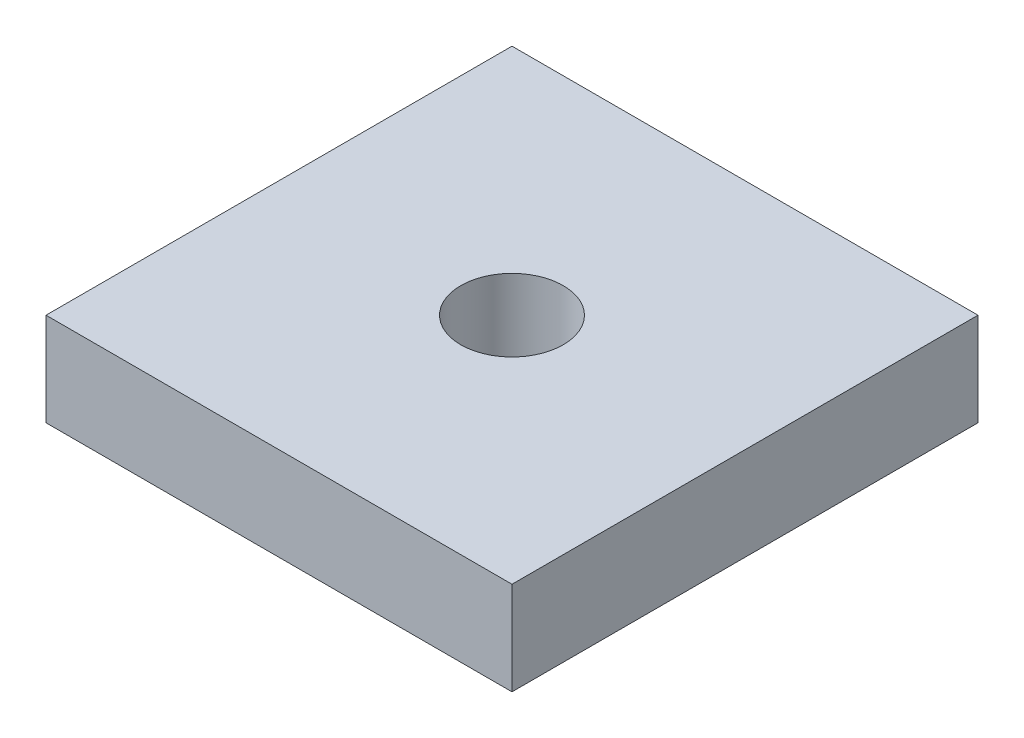
ISO-10303-21;
HEADER;
FILE_DESCRIPTION(('STEP AP214'),'2;1');
FILE_NAME('part.step','',(''),(''),'','','');
FILE_SCHEMA(('AUTOMOTIVE_DESIGN { 1 0 10303 214 1 1 1 1 }'));
ENDSEC;
DATA;
#1=APPLICATION_CONTEXT('core data for automotive mechanical design processes');
#2=APPLICATION_PROTOCOL_DEFINITION('international standard','automotive_design',2000,#1);
#3=PRODUCT_CONTEXT('',#1,'mechanical');
#4=PRODUCT('Part','Part','',(#3));
#5=PRODUCT_RELATED_PRODUCT_CATEGORY('part','',(#4));
#6=PRODUCT_DEFINITION_FORMATION('','',#4);
#7=PRODUCT_DEFINITION_CONTEXT('part definition',#1,'design');
#8=PRODUCT_DEFINITION('design','',#6,#7);
#9=PRODUCT_DEFINITION_SHAPE('','',#8);
#10=(LENGTH_UNIT() NAMED_UNIT(*) SI_UNIT(.MILLI.,.METRE.));
#11=(NAMED_UNIT(*) PLANE_ANGLE_UNIT() SI_UNIT($,.RADIAN.));
#12=(NAMED_UNIT(*) SI_UNIT($,.STERADIAN.) SOLID_ANGLE_UNIT());
#13=UNCERTAINTY_MEASURE_WITH_UNIT(LENGTH_MEASURE(1.E-05),#10,'distance_accuracy_value','');
#14=(GEOMETRIC_REPRESENTATION_CONTEXT(3) GLOBAL_UNCERTAINTY_ASSIGNED_CONTEXT((#13)) GLOBAL_UNIT_ASSIGNED_CONTEXT((#10,
#11,#12)) REPRESENTATION_CONTEXT('',''));
#15=CARTESIAN_POINT('',(0.,0.,0.));
#16=DIRECTION('',(0.,0.,1.));
#17=DIRECTION('',(1.,0.,0.));
#18=AXIS2_PLACEMENT_3D('',#15,#16,#17);
#19=CARTESIAN_POINT('',(-15.,-785.115322881008,-2165.80523144399));
#20=DIRECTION('',(0.,0.,-1.));
#21=DIRECTION('',(-1.,0.,0.));
#22=AXIS2_PLACEMENT_3D('',#19,#20,#21);
#23=PLANE('',#22);
#24=DIRECTION('',(0.,1.,0.));
#25=VECTOR('',#24,1.);
#26=CARTESIAN_POINT('',(0.,-785.115322881008,-2165.80523144399));
#27=LINE('',#26,#25);
#28=CARTESIAN_POINT('',(0.,-788.115322881008,-2165.80523144399));
#29=VERTEX_POINT('',#28);
#30=CARTESIAN_POINT('',(0.,-785.115322881008,-2165.80523144399));
#31=VERTEX_POINT('',#30);
#32=EDGE_CURVE('E100',#29,#31,#27,.T.);
#33=ORIENTED_EDGE('',*,*,#32,.T.);
#34=DIRECTION('',(1.,0.,0.));
#35=VECTOR('',#34,1.);
#36=CARTESIAN_POINT('',(-15.,-785.115322881008,-2165.80523144399));
#37=LINE('',#36,#35);
#38=CARTESIAN_POINT('',(-15.,-785.115322881008,-2165.80523144399));
#39=VERTEX_POINT('',#38);
#40=EDGE_CURVE('E11',#39,#31,#37,.T.);
#41=ORIENTED_EDGE('',*,*,#40,.F.);
#42=DIRECTION('',(0.,1.,0.));
#43=VECTOR('',#42,1.);
#44=CARTESIAN_POINT('',(-15.,-785.115322881008,-2165.80523144399));
#45=LINE('',#44,#43);
#46=CARTESIAN_POINT('',(-15.,-788.115322881008,-2165.80523144399));
#47=VERTEX_POINT('',#46);
#48=EDGE_CURVE('E88',#47,#39,#45,.T.);
#49=ORIENTED_EDGE('',*,*,#48,.F.);
#50=DIRECTION('',(1.,0.,0.));
#51=VECTOR('',#50,1.);
#52=CARTESIAN_POINT('',(-15.,-788.115322881008,-2165.80523144399));
#53=LINE('',#52,#51);
#54=EDGE_CURVE('E96',#47,#29,#53,.T.);
#55=ORIENTED_EDGE('',*,*,#54,.T.);
#56=EDGE_LOOP('',(#33,#41,#49,#55));
#57=FACE_BOUND('',#56,.T.);
#58=ADVANCED_FACE('F37',(#57),#23,.F.);
#59=CARTESIAN_POINT('',(-15.,-785.115322881008,-2180.80523144399));
#60=DIRECTION('',(0.,-1.,0.));
#61=DIRECTION('',(0.,0.,-1.));
#62=AXIS2_PLACEMENT_3D('',#59,#60,#61);
#63=PLANE('',#62);
#64=CARTESIAN_POINT('',(-7.5,-785.115322881008,-2173.30523144399));
#65=DIRECTION('',(0.,1.,0.));
#66=DIRECTION('',(0.,0.,1.));
#67=AXIS2_PLACEMENT_3D('',#64,#65,#66);
#68=CIRCLE('',#67,1.65);
#69=CARTESIAN_POINT('',(-7.5,-785.115322881008,-2171.65523144399));
#70=VERTEX_POINT('',#69);
#71=EDGE_CURVE('E116',#70,#70,#68,.T.);
#72=ORIENTED_EDGE('',*,*,#71,.F.);
#73=EDGE_LOOP('',(#72));
#74=FACE_BOUND('',#73,.T.);
#75=DIRECTION('',(0.,0.,-1.));
#76=VECTOR('',#75,1.);
#77=CARTESIAN_POINT('',(0.,-785.115322881008,-2180.80523144399));
#78=LINE('',#77,#76);
#79=CARTESIAN_POINT('',(0.,-785.115322881008,-2180.80523144399));
#80=VERTEX_POINT('',#79);
#81=EDGE_CURVE('E92',#31,#80,#78,.T.);
#82=ORIENTED_EDGE('',*,*,#81,.T.);
#83=DIRECTION('',(1.,0.,0.));
#84=VECTOR('',#83,1.);
#85=CARTESIAN_POINT('',(-15.,-785.115322881008,-2180.80523144399));
#86=LINE('',#85,#84);
#87=CARTESIAN_POINT('',(-15.,-785.115322881008,-2180.80523144399));
#88=VERTEX_POINT('',#87);
#89=EDGE_CURVE('E45',#88,#80,#86,.T.);
#90=ORIENTED_EDGE('',*,*,#89,.F.);
#91=DIRECTION('',(0.,0.,-1.));
#92=VECTOR('',#91,1.);
#93=CARTESIAN_POINT('',(-15.,-785.115322881008,-2180.80523144399));
#94=LINE('',#93,#92);
#95=EDGE_CURVE('E83',#39,#88,#94,.T.);
#96=ORIENTED_EDGE('',*,*,#95,.F.);
#97=ORIENTED_EDGE('',*,*,#40,.T.);
#98=EDGE_LOOP('',(#82,#90,#96,#97));
#99=FACE_BOUND('',#98,.T.);
#100=ADVANCED_FACE('F91',(#74,#99),#63,.F.);
#101=CARTESIAN_POINT('',(-15.,-788.115322881008,-2180.80523144399));
#102=DIRECTION('',(0.,0.,1.));
#103=DIRECTION('',(1.,0.,0.));
#104=AXIS2_PLACEMENT_3D('',#101,#102,#103);
#105=PLANE('',#104);
#106=DIRECTION('',(0.,-1.,0.));
#107=VECTOR('',#106,1.);
#108=CARTESIAN_POINT('',(0.,-788.115322881008,-2180.80523144399));
#109=LINE('',#108,#107);
#110=CARTESIAN_POINT('',(0.,-788.115322881008,-2180.80523144399));
#111=VERTEX_POINT('',#110);
#112=EDGE_CURVE('E70',#80,#111,#109,.T.);
#113=ORIENTED_EDGE('',*,*,#112,.T.);
#114=DIRECTION('',(1.,0.,0.));
#115=VECTOR('',#114,1.);
#116=CARTESIAN_POINT('',(-15.,-788.115322881008,-2180.80523144399));
#117=LINE('',#116,#115);
#118=CARTESIAN_POINT('',(-15.,-788.115322881008,-2180.80523144399));
#119=VERTEX_POINT('',#118);
#120=EDGE_CURVE('E93',#119,#111,#117,.T.);
#121=ORIENTED_EDGE('',*,*,#120,.F.);
#122=DIRECTION('',(0.,-1.,0.));
#123=VECTOR('',#122,1.);
#124=CARTESIAN_POINT('',(-15.,-788.115322881008,-2180.80523144399));
#125=LINE('',#124,#123);
#126=EDGE_CURVE('E86',#88,#119,#125,.T.);
#127=ORIENTED_EDGE('',*,*,#126,.F.);
#128=ORIENTED_EDGE('',*,*,#89,.T.);
#129=EDGE_LOOP('',(#113,#121,#127,#128));
#130=FACE_BOUND('',#129,.T.);
#131=ADVANCED_FACE('F94',(#130),#105,.F.);
#132=CARTESIAN_POINT('',(-15.,-788.115322881008,-2165.80523144399));
#133=DIRECTION('',(0.,1.,0.));
#134=DIRECTION('',(0.,0.,1.));
#135=AXIS2_PLACEMENT_3D('',#132,#133,#134);
#136=PLANE('',#135);
#137=CARTESIAN_POINT('',(-7.5,-788.115322881008,-2173.30523144399));
#138=DIRECTION('',(0.,1.,0.));
#139=DIRECTION('',(0.,0.,1.));
#140=AXIS2_PLACEMENT_3D('',#137,#138,#139);
#141=CIRCLE('',#140,1.65);
#142=CARTESIAN_POINT('',(-7.5,-788.115322881008,-2171.65523144399));
#143=VERTEX_POINT('',#142);
#144=EDGE_CURVE('E103',#143,#143,#141,.T.);
#145=ORIENTED_EDGE('',*,*,#144,.T.);
#146=EDGE_LOOP('',(#145));
#147=FACE_BOUND('',#146,.T.);
#148=DIRECTION('',(0.,0.,1.));
#149=VECTOR('',#148,1.);
#150=CARTESIAN_POINT('',(0.,-788.115322881008,-2165.80523144399));
#151=LINE('',#150,#149);
#152=EDGE_CURVE('E76',#111,#29,#151,.T.);
#153=ORIENTED_EDGE('',*,*,#152,.T.);
#154=ORIENTED_EDGE('',*,*,#54,.F.);
#155=DIRECTION('',(0.,0.,1.));
#156=VECTOR('',#155,1.);
#157=CARTESIAN_POINT('',(-15.,-788.115322881008,-2165.80523144399));
#158=LINE('',#157,#156);
#159=EDGE_CURVE('E53',#119,#47,#158,.T.);
#160=ORIENTED_EDGE('',*,*,#159,.F.);
#161=ORIENTED_EDGE('',*,*,#120,.T.);
#162=EDGE_LOOP('',(#153,#154,#160,#161));
#163=FACE_BOUND('',#162,.T.);
#164=ADVANCED_FACE('F108',(#147,#163),#136,.F.);
#165=CARTESIAN_POINT('',(-15.,-788.115322881008,-2165.80523144399));
#166=DIRECTION('',(1.,0.,0.));
#167=DIRECTION('',(0.,0.,-1.));
#168=AXIS2_PLACEMENT_3D('',#165,#166,#167);
#169=PLANE('',#168);
#170=ORIENTED_EDGE('',*,*,#48,.T.);
#171=ORIENTED_EDGE('',*,*,#95,.T.);
#172=ORIENTED_EDGE('',*,*,#126,.T.);
#173=ORIENTED_EDGE('',*,*,#159,.T.);
#174=EDGE_LOOP('',(#170,#171,#172,#173));
#175=FACE_BOUND('',#174,.T.);
#176=ADVANCED_FACE('F84',(#175),#169,.F.);
#177=CARTESIAN_POINT('',(0.,-788.115322881008,-2165.80523144399));
#178=DIRECTION('',(1.,0.,0.));
#179=DIRECTION('',(0.,0.,-1.));
#180=AXIS2_PLACEMENT_3D('',#177,#178,#179);
#181=PLANE('',#180);
#182=ORIENTED_EDGE('',*,*,#32,.F.);
#183=ORIENTED_EDGE('',*,*,#152,.F.);
#184=ORIENTED_EDGE('',*,*,#112,.F.);
#185=ORIENTED_EDGE('',*,*,#81,.F.);
#186=EDGE_LOOP('',(#182,#183,#184,#185));
#187=FACE_BOUND('',#186,.T.);
#188=ADVANCED_FACE('F111',(#187),#181,.T.);
#189=CARTESIAN_POINT('',(-7.5,-785.115322881008,-2173.30523144399));
#190=DIRECTION('',(0.,1.,0.));
#191=DIRECTION('',(0.,0.,1.));
#192=AXIS2_PLACEMENT_3D('',#189,#190,#191);
#193=CYLINDRICAL_SURFACE('',#192,1.65);
#194=ORIENTED_EDGE('',*,*,#71,.T.);
#195=EDGE_LOOP('',(#194));
#196=FACE_BOUND('',#195,.T.);
#197=ORIENTED_EDGE('',*,*,#144,.F.);
#198=EDGE_LOOP('',(#197));
#199=FACE_BOUND('',#198,.T.);
#200=ADVANCED_FACE('F120',(#196,#199),#193,.F.);
#201=CLOSED_SHELL('',(#58,#100,#131,#164,#176,#188,#200));
#202=MANIFOLD_SOLID_BREP('B2',#201);
#203=ADVANCED_BREP_SHAPE_REPRESENTATION('',(#18,#202),#14);
#204=SHAPE_DEFINITION_REPRESENTATION(#9,#203);
ENDSEC;
END-ISO-10303-21;
